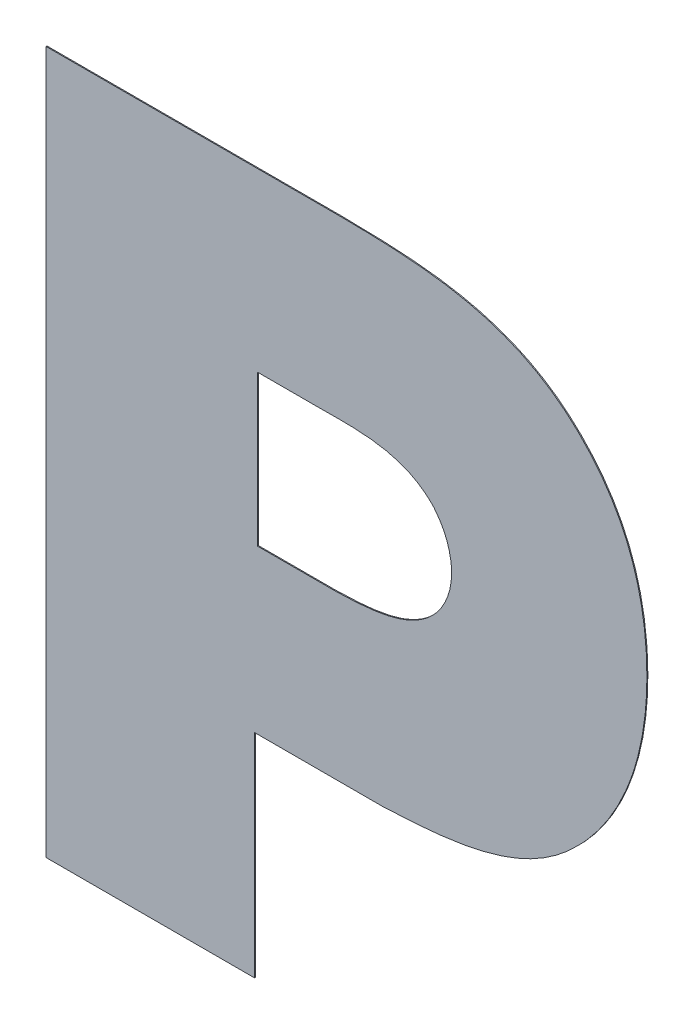
ISO-10303-21;
HEADER;
FILE_DESCRIPTION(('STEP AP214'),'2;1');
FILE_NAME('part.step','',(''),(''),'','','');
FILE_SCHEMA(('AUTOMOTIVE_DESIGN { 1 0 10303 214 1 1 1 1 }'));
ENDSEC;
DATA;
#1=APPLICATION_CONTEXT('core data for automotive mechanical design processes');
#2=APPLICATION_PROTOCOL_DEFINITION('international standard','automotive_design',2000,#1);
#3=PRODUCT_CONTEXT('',#1,'mechanical');
#4=PRODUCT('Part','Part','',(#3));
#5=PRODUCT_RELATED_PRODUCT_CATEGORY('part','',(#4));
#6=PRODUCT_DEFINITION_FORMATION('','',#4);
#7=PRODUCT_DEFINITION_CONTEXT('part definition',#1,'design');
#8=PRODUCT_DEFINITION('design','',#6,#7);
#9=PRODUCT_DEFINITION_SHAPE('','',#8);
#10=(LENGTH_UNIT() NAMED_UNIT(*) SI_UNIT(.MILLI.,.METRE.));
#11=(NAMED_UNIT(*) PLANE_ANGLE_UNIT() SI_UNIT($,.RADIAN.));
#12=(NAMED_UNIT(*) SI_UNIT($,.STERADIAN.) SOLID_ANGLE_UNIT());
#13=UNCERTAINTY_MEASURE_WITH_UNIT(LENGTH_MEASURE(1.E-05),#10,'distance_accuracy_value','');
#14=(GEOMETRIC_REPRESENTATION_CONTEXT(3) GLOBAL_UNCERTAINTY_ASSIGNED_CONTEXT((#13)) GLOBAL_UNIT_ASSIGNED_CONTEXT((#10,
#11,#12)) REPRESENTATION_CONTEXT('',''));
#15=CARTESIAN_POINT('',(0.,0.,0.));
#16=DIRECTION('',(0.,0.,1.));
#17=DIRECTION('',(1.,0.,0.));
#18=AXIS2_PLACEMENT_3D('',#15,#16,#17);
#19=CARTESIAN_POINT('',(2.148991744242,-0.26665578525633,0.));
#20=DIRECTION('',(0.,-1.,0.));
#21=DIRECTION('',(1.,0.,0.));
#22=AXIS2_PLACEMENT_3D('',#19,#20,#21);
#23=PLANE('',#22);
#24=DIRECTION('',(1.,0.,0.));
#25=VECTOR('',#24,1.);
#26=CARTESIAN_POINT('',(2.1490409629657,-0.26665578525633,0.));
#27=LINE('',#26,#25);
#28=CARTESIAN_POINT('',(2.148991744242,-0.26665578525633,0.));
#29=VERTEX_POINT('',#28);
#30=CARTESIAN_POINT('',(2.1571705659487,-0.26665578525633,0.));
#31=VERTEX_POINT('',#30);
#32=EDGE_CURVE('E11',#29,#31,#27,.T.);
#33=ORIENTED_EDGE('',*,*,#32,.F.);
#34=DIRECTION('',(0.,0.,1.));
#35=VECTOR('',#34,1.);
#36=CARTESIAN_POINT('',(2.148991744242,-0.26665578525633,0.));
#37=LINE('',#36,#35);
#38=CARTESIAN_POINT('',(2.148991744242,-0.26665578525633,0.0001));
#39=VERTEX_POINT('',#38);
#40=EDGE_CURVE('E24',#29,#39,#37,.T.);
#41=ORIENTED_EDGE('',*,*,#40,.T.);
#42=DIRECTION('',(-1.,0.,0.));
#43=VECTOR('',#42,1.);
#44=CARTESIAN_POINT('',(2.1490409629657,-0.26665578525633,0.0001));
#45=LINE('',#44,#43);
#46=CARTESIAN_POINT('',(2.1571705659487,-0.26665578525633,0.0001));
#47=VERTEX_POINT('',#46);
#48=EDGE_CURVE('E296',#47,#39,#45,.T.);
#49=ORIENTED_EDGE('',*,*,#48,.F.);
#50=DIRECTION('',(0.,0.,1.));
#51=VECTOR('',#50,1.);
#52=CARTESIAN_POINT('',(2.1571705659487,-0.26665578525633,0.));
#53=LINE('',#52,#51);
#54=EDGE_CURVE('E293',#31,#47,#53,.T.);
#55=ORIENTED_EDGE('',*,*,#54,.F.);
#56=EDGE_LOOP('',(#33,#41,#49,#55));
#57=FACE_BOUND('',#56,.T.);
#58=ADVANCED_FACE('F17',(#57),#23,.F.);
#59=CARTESIAN_POINT('',(2.148991744242,-0.25069301416632,0.));
#60=DIRECTION('',(-1.,0.,0.));
#61=DIRECTION('',(0.,-1.,0.));
#62=AXIS2_PLACEMENT_3D('',#59,#60,#61);
#63=PLANE('',#62);
#64=DIRECTION('',(0.,-1.,0.));
#65=VECTOR('',#64,1.);
#66=CARTESIAN_POINT('',(2.148991744242,-0.259094380213193,0.));
#67=LINE('',#66,#65);
#68=CARTESIAN_POINT('',(2.148991744242,-0.25069301416632,0.));
#69=VERTEX_POINT('',#68);
#70=EDGE_CURVE('E291',#69,#29,#67,.T.);
#71=ORIENTED_EDGE('',*,*,#70,.F.);
#72=DIRECTION('',(0.,0.,1.));
#73=VECTOR('',#72,1.);
#74=CARTESIAN_POINT('',(2.148991744242,-0.25069301416632,0.));
#75=LINE('',#74,#73);
#76=CARTESIAN_POINT('',(2.148991744242,-0.25069301416632,0.0001));
#77=VERTEX_POINT('',#76);
#78=EDGE_CURVE('E289',#69,#77,#75,.T.);
#79=ORIENTED_EDGE('',*,*,#78,.T.);
#80=DIRECTION('',(0.,1.,0.));
#81=VECTOR('',#80,1.);
#82=CARTESIAN_POINT('',(2.148991744242,-0.259094380213193,0.0001));
#83=LINE('',#82,#81);
#84=EDGE_CURVE('E286',#39,#77,#83,.T.);
#85=ORIENTED_EDGE('',*,*,#84,.F.);
#86=ORIENTED_EDGE('',*,*,#40,.F.);
#87=EDGE_LOOP('',(#71,#79,#85,#86));
#88=FACE_BOUND('',#87,.T.);
#89=ADVANCED_FACE('F302',(#88),#63,.F.);
#90=CARTESIAN_POINT('',(2.1551023631287,-0.25069301416632,0.));
#91=DIRECTION('',(0.,1.,0.));
#92=DIRECTION('',(-1.,0.,0.));
#93=AXIS2_PLACEMENT_3D('',#90,#91,#92);
#94=PLANE('',#93);
#95=DIRECTION('',(-1.,0.,0.));
#96=VECTOR('',#95,1.);
#97=CARTESIAN_POINT('',(2.1520962724091,-0.25069301416632,0.));
#98=LINE('',#97,#96);
#99=CARTESIAN_POINT('',(2.1551023631287,-0.25069301416632,0.));
#100=VERTEX_POINT('',#99);
#101=EDGE_CURVE('E283',#100,#69,#98,.T.);
#102=ORIENTED_EDGE('',*,*,#101,.F.);
#103=DIRECTION('',(0.,0.,1.));
#104=VECTOR('',#103,1.);
#105=CARTESIAN_POINT('',(2.1551023631287,-0.25069301416632,0.));
#106=LINE('',#105,#104);
#107=CARTESIAN_POINT('',(2.1551023631287,-0.25069301416632,0.0001));
#108=VERTEX_POINT('',#107);
#109=EDGE_CURVE('E281',#100,#108,#106,.T.);
#110=ORIENTED_EDGE('',*,*,#109,.T.);
#111=DIRECTION('',(1.,0.,0.));
#112=VECTOR('',#111,1.);
#113=CARTESIAN_POINT('',(2.1520962724091,-0.25069301416632,0.0001));
#114=LINE('',#113,#112);
#115=EDGE_CURVE('E275',#77,#108,#114,.T.);
#116=ORIENTED_EDGE('',*,*,#115,.F.);
#117=ORIENTED_EDGE('',*,*,#78,.F.);
#118=EDGE_LOOP('',(#102,#110,#116,#117));
#119=FACE_BOUND('',#118,.T.);
#120=ADVANCED_FACE('F305',(#119),#94,.F.);
#121=CARTESIAN_POINT('',(2.1676996108021,-0.25376713765168,0.));
#122=CARTESIAN_POINT('',(2.1676996108021,-0.25376713765168,0.0001));
#123=CARTESIAN_POINT('',(2.1645032943995,-0.250298193469789,0.));
#124=CARTESIAN_POINT('',(2.1645032943995,-0.250298193469789,0.0001));
#125=CARTESIAN_POINT('',(2.1593327841266,-0.250693014217955,0.));
#126=CARTESIAN_POINT('',(2.1593327841266,-0.250693014217955,0.0001));
#127=CARTESIAN_POINT('',(2.1551023631287,-0.25069301416632,0.));
#128=CARTESIAN_POINT('',(2.1551023631287,-0.25069301416632,0.0001));
#129=B_SPLINE_SURFACE_WITH_KNOTS('',3,1,((#121,#122),(#123,#124),(#125,#126),(#127,#128)),
.UNSPECIFIED.,.F.,.F.,.F.,(4,4),(2,2),(-1.,0.),(0.,1.E-05),.UNSPECIFIED.);
#130=CARTESIAN_POINT('',(2.1676996108021,-0.25376713765168,0.));
#131=CARTESIAN_POINT('',(2.1645032943995,-0.250298193469789,0.));
#132=CARTESIAN_POINT('',(2.1593327841266,-0.250693014217955,0.));
#133=CARTESIAN_POINT('',(2.1551023631287,-0.25069301416632,0.));
#134=B_SPLINE_CURVE_WITH_KNOTS('',3,(#130,#131,#132,#133),.UNSPECIFIED.,.F.,.F.,(4,4),(-1.,0.),.UNSPECIFIED.);
#135=CARTESIAN_POINT('',(2.1676996108021,-0.25376713765168,0.));
#136=VERTEX_POINT('',#135);
#137=EDGE_CURVE('E270',#136,#100,#134,.T.);
#138=DIRECTION('',(0.,0.,1.));
#139=VECTOR('',#138,1.);
#140=CARTESIAN_POINT('',(2.1676996108021,-0.25376713765168,0.));
#141=LINE('',#140,#139);
#142=CARTESIAN_POINT('',(2.1676996108021,-0.25376713765168,0.0001));
#143=VERTEX_POINT('',#142);
#144=EDGE_CURVE('E264',#136,#143,#141,.T.);
#145=CARTESIAN_POINT('',(2.1551023631287,-0.25069301416632,0.0001));
#146=CARTESIAN_POINT('',(2.1593327841266,-0.250693014217955,0.0001));
#147=CARTESIAN_POINT('',(2.1645032943995,-0.250298193469789,0.0001));
#148=CARTESIAN_POINT('',(2.1676996108021,-0.25376713765168,0.0001));
#149=B_SPLINE_CURVE_WITH_KNOTS('',3,(#145,#146,#147,#148),.UNSPECIFIED.,.F.,.F.,(4,4),(0.,1.),.UNSPECIFIED.);
#150=EDGE_CURVE('E260',#108,#143,#149,.T.);
#151=ORIENTED_EDGE('',*,*,#137,.F.);
#152=ORIENTED_EDGE('',*,*,#144,.T.);
#153=ORIENTED_EDGE('',*,*,#150,.F.);
#154=ORIENTED_EDGE('',*,*,#109,.F.);
#155=EDGE_LOOP('',(#151,#152,#153,#154));
#156=FACE_BOUND('',#155,.T.);
#157=ADVANCED_FACE('F310',(#156),#129,.F.);
#158=CARTESIAN_POINT('',(2.1695797828686,-0.25872142675248,0.));
#159=CARTESIAN_POINT('',(2.16947376318438,-0.255884105252941,0.));
#160=CARTESIAN_POINT('',(2.1676996108021,-0.25376713765168,0.));
#161=CARTESIAN_POINT('',(2.1695797828686,-0.25872142675248,0.0001));
#162=CARTESIAN_POINT('',(2.16947376318438,-0.255884105252941,0.0001));
#163=CARTESIAN_POINT('',(2.1676996108021,-0.25376713765168,0.0001));
#164=(BOUNDED_SURFACE() B_SPLINE_SURFACE(1,2,((#158,#159,#160),(#161,#162,#163)),.UNSPECIFIED.,
.F.,.F.,.F.) B_SPLINE_SURFACE_WITH_KNOTS((2,2),(3,3),(0.,0.0016733285659705),(-3.28337692066341,
-3.03707587900119),
.UNSPECIFIED.) GEOMETRIC_REPRESENTATION_ITEM() RATIONAL_B_SPLINE_SURFACE(((1.,0.992426553478268,
1.),(1.,0.992426553478268,1.))) REPRESENTATION_ITEM('') SURFACE());
#165=CARTESIAN_POINT('',(2.1141992768274,-0.279753424382636,0.));
#166=DIRECTION('',(0.,0.,1.));
#167=DIRECTION('',(-0.915373470419152,-0.40260577449013,0.));
#168=AXIS2_PLACEMENT_3D('',#165,#166,#167);
#169=ELLIPSE('',#168,0.0597611264360387,0.0215440188188566);
#170=CARTESIAN_POINT('',(2.1695797828686,-0.25872142675248,0.));
#171=VERTEX_POINT('',#170);
#172=EDGE_CURVE('E257',#171,#136,#169,.T.);
#173=DIRECTION('',(0.,0.,1.));
#174=VECTOR('',#173,1.);
#175=CARTESIAN_POINT('',(2.1695797828686,-0.25872142675248,0.));
#176=LINE('',#175,#174);
#177=CARTESIAN_POINT('',(2.1695797828686,-0.25872142675248,0.0001));
#178=VERTEX_POINT('',#177);
#179=EDGE_CURVE('E255',#171,#178,#176,.T.);
#180=CARTESIAN_POINT('',(2.1141992768274,-0.279753424382636,0.0001));
#181=DIRECTION('',(0.,0.,-1.));
#182=DIRECTION('',(-0.915373470419152,-0.40260577449013,0.));
#183=AXIS2_PLACEMENT_3D('',#180,#181,#182);
#184=ELLIPSE('',#183,0.0597611264360387,0.0215440188188566);
#185=EDGE_CURVE('E252',#143,#178,#184,.T.);
#186=ORIENTED_EDGE('',*,*,#172,.F.);
#187=ORIENTED_EDGE('',*,*,#179,.T.);
#188=ORIENTED_EDGE('',*,*,#185,.F.);
#189=ORIENTED_EDGE('',*,*,#144,.F.);
#190=EDGE_LOOP('',(#186,#187,#188,#189));
#191=FACE_BOUND('',#190,.T.);
#192=ADVANCED_FACE('F333',(#191),#164,.T.);
#193=CARTESIAN_POINT('',(2.1676055954254,-0.263685108359646,0.));
#194=CARTESIAN_POINT('',(2.16958018716928,-0.261617770814213,0.));
#195=CARTESIAN_POINT('',(2.1695797828686,-0.25872142675248,0.));
#196=CARTESIAN_POINT('',(2.1676055954254,-0.263685108359646,0.0001));
#197=CARTESIAN_POINT('',(2.16958018716928,-0.261617770814213,0.0001));
#198=CARTESIAN_POINT('',(2.1695797828686,-0.25872142675248,0.0001));
#199=(BOUNDED_SURFACE() B_SPLINE_SURFACE(1,2,((#193,#194,#195),(#196,#197,#198)),.UNSPECIFIED.,
.F.,.F.,.F.) B_SPLINE_SURFACE_WITH_KNOTS((2,2),(3,3),(0.,0.0036284308680038),(-3.32565261163518,
-2.93267418086352),
.UNSPECIFIED.) GEOMETRIC_REPRESENTATION_ITEM() RATIONAL_B_SPLINE_SURFACE(((1.,0.980758021685963,
1.),(1.,0.980758021685963,1.))) REPRESENTATION_ITEM('') SURFACE());
#200=CARTESIAN_POINT('',(2.1436709223315,-0.250742331624989,0.));
#201=DIRECTION('',(0.,0.,1.));
#202=DIRECTION('',(-0.919658977595631,0.392717920303822,0.));
#203=AXIS2_PLACEMENT_3D('',#200,#201,#202);
#204=ELLIPSE('',#203,0.0275601227191125,0.0136779163636743);
#205=CARTESIAN_POINT('',(2.1676055954254,-0.263685108359646,0.));
#206=VERTEX_POINT('',#205);
#207=EDGE_CURVE('E249',#206,#171,#204,.T.);
#208=DIRECTION('',(0.,0.,1.));
#209=VECTOR('',#208,1.);
#210=CARTESIAN_POINT('',(2.1676055954254,-0.263685108359646,0.));
#211=LINE('',#210,#209);
#212=CARTESIAN_POINT('',(2.1676055954254,-0.263685108359646,0.0001));
#213=VERTEX_POINT('',#212);
#214=EDGE_CURVE('E247',#206,#213,#211,.T.);
#215=CARTESIAN_POINT('',(2.1436709223315,-0.250742331624989,0.0001));
#216=DIRECTION('',(0.,0.,-1.));
#217=DIRECTION('',(-0.919658977595631,0.392717920303822,0.));
#218=AXIS2_PLACEMENT_3D('',#215,#216,#217);
#219=ELLIPSE('',#218,0.0275601227191125,0.0136779163636743);
#220=EDGE_CURVE('E241',#178,#213,#219,.T.);
#221=ORIENTED_EDGE('',*,*,#207,.F.);
#222=ORIENTED_EDGE('',*,*,#214,.T.);
#223=ORIENTED_EDGE('',*,*,#220,.F.);
#224=ORIENTED_EDGE('',*,*,#179,.F.);
#225=EDGE_LOOP('',(#221,#222,#223,#224));
#226=FACE_BOUND('',#225,.T.);
#227=ADVANCED_FACE('F317',(#226),#199,.T.);
#228=CARTESIAN_POINT('',(2.1571705659487,-0.26665578525633,0.));
#229=CARTESIAN_POINT('',(2.1571705659487,-0.26665578525633,0.0001));
#230=CARTESIAN_POINT('',(2.1608369140555,-0.266561789155003,0.));
#231=CARTESIAN_POINT('',(2.1608369140555,-0.266561789155003,0.0001));
#232=CARTESIAN_POINT('',(2.1649733261424,-0.266364365807923,0.));
#233=CARTESIAN_POINT('',(2.1649733261424,-0.266364365807923,0.0001));
#234=CARTESIAN_POINT('',(2.1676055954254,-0.263685108359646,0.));
#235=CARTESIAN_POINT('',(2.1676055954254,-0.263685108359646,0.0001));
#236=B_SPLINE_SURFACE_WITH_KNOTS('',3,1,((#228,#229),(#230,#231),(#232,#233),(#234,#235)),
.UNSPECIFIED.,.F.,.F.,.F.,(4,4),(2,2),(-1.,0.),(0.,1.E-05),.UNSPECIFIED.);
#237=CARTESIAN_POINT('',(2.1571705659487,-0.26665578525633,0.));
#238=CARTESIAN_POINT('',(2.1608369140555,-0.266561789155003,0.));
#239=CARTESIAN_POINT('',(2.1649733261424,-0.266364365807923,0.));
#240=CARTESIAN_POINT('',(2.1676055954254,-0.263685108359646,0.));
#241=B_SPLINE_CURVE_WITH_KNOTS('',3,(#237,#238,#239,#240),.UNSPECIFIED.,.F.,.F.,(4,4),(-1.,0.),.UNSPECIFIED.);
#242=EDGE_CURVE('E234',#31,#206,#241,.T.);
#243=CARTESIAN_POINT('',(2.1676055954254,-0.263685108359646,0.0001));
#244=CARTESIAN_POINT('',(2.1649733261424,-0.266364365807923,0.0001));
#245=CARTESIAN_POINT('',(2.1608369140555,-0.266561789155003,0.0001));
#246=CARTESIAN_POINT('',(2.1571705659487,-0.26665578525633,0.0001));
#247=B_SPLINE_CURVE_WITH_KNOTS('',3,(#243,#244,#245,#246),.UNSPECIFIED.,.F.,.F.,(4,4),(0.,1.),.UNSPECIFIED.);
#248=EDGE_CURVE('E229',#213,#47,#247,.T.);
#249=ORIENTED_EDGE('',*,*,#242,.F.);
#250=ORIENTED_EDGE('',*,*,#54,.T.);
#251=ORIENTED_EDGE('',*,*,#248,.F.);
#252=ORIENTED_EDGE('',*,*,#214,.F.);
#253=EDGE_LOOP('',(#249,#250,#251,#252));
#254=FACE_BOUND('',#253,.T.);
#255=ADVANCED_FACE('F321',(#254),#236,.F.);
#256=CARTESIAN_POINT('',(2.1826470816222,-0.27745745793,0.));
#257=CARTESIAN_POINT('',(2.1826470816222,-0.27745745793,0.0001));
#258=CARTESIAN_POINT('',(2.1857493826267,-0.274552580185439,0.));
#259=CARTESIAN_POINT('',(2.1857493826267,-0.274552580185439,0.0001));
#260=CARTESIAN_POINT('',(2.1902618046175,-0.268319761951759,0.));
#261=CARTESIAN_POINT('',(2.1902618046175,-0.268319761951759,0.0001));
#262=CARTESIAN_POINT('',(2.1902618046175,-0.257959943486377,0.));
#263=CARTESIAN_POINT('',(2.1902618046175,-0.257959943486377,0.0001));
#264=B_SPLINE_SURFACE_WITH_KNOTS('',3,1,((#256,#257),(#258,#259),(#260,#261),(#262,#263)),
.UNSPECIFIED.,.F.,.F.,.F.,(4,4),(2,2),(-1.,0.),(0.,1.E-05),.UNSPECIFIED.);
#265=CARTESIAN_POINT('',(2.1644326296189,-0.253470463650479,0.));
#266=DIRECTION('',(0.,0.,-1.));
#267=DIRECTION('',(-0.413300305480635,0.910594782265753,0.));
#268=AXIS2_PLACEMENT_3D('',#265,#266,#267);
#269=ELLIPSE('',#268,0.0304988381918747,0.0247583572626639);
#270=CARTESIAN_POINT('',(2.1902618046175,-0.257959943486377,0.));
#271=VERTEX_POINT('',#270);
#272=CARTESIAN_POINT('',(2.1826470816222,-0.27745745793,0.));
#273=VERTEX_POINT('',#272);
#274=EDGE_CURVE('E227',#271,#273,#269,.T.);
#275=DIRECTION('',(0.,0.,1.));
#276=VECTOR('',#275,1.);
#277=CARTESIAN_POINT('',(2.1902618046175,-0.257959943486377,0.));
#278=LINE('',#277,#276);
#279=CARTESIAN_POINT('',(2.1902618046175,-0.257959943486377,0.0001));
#280=VERTEX_POINT('',#279);
#281=EDGE_CURVE('E225',#271,#280,#278,.T.);
#282=CARTESIAN_POINT('',(2.1644326296189,-0.253470463650479,0.0001));
#283=DIRECTION('',(0.,0.,1.));
#284=DIRECTION('',(0.413300305480625,-0.910594782265758,0.));
#285=AXIS2_PLACEMENT_3D('',#282,#283,#284);
#286=ELLIPSE('',#285,0.0304988381918745,0.0247583572626637);
#287=CARTESIAN_POINT('',(2.1826470816222,-0.27745745793,0.0001));
#288=VERTEX_POINT('',#287);
#289=EDGE_CURVE('E152',#288,#280,#286,.T.);
#290=DIRECTION('',(0.,0.,1.));
#291=VECTOR('',#290,1.);
#292=CARTESIAN_POINT('',(2.1826470816222,-0.27745745793,0.));
#293=LINE('',#292,#291);
#294=EDGE_CURVE('E218',#273,#288,#293,.T.);
#295=ORIENTED_EDGE('',*,*,#274,.F.);
#296=ORIENTED_EDGE('',*,*,#281,.T.);
#297=ORIENTED_EDGE('',*,*,#289,.F.);
#298=ORIENTED_EDGE('',*,*,#294,.F.);
#299=EDGE_LOOP('',(#295,#296,#297,#298));
#300=FACE_BOUND('',#299,.T.);
#301=ADVANCED_FACE('F323',(#300),#264,.T.);
#302=CARTESIAN_POINT('',(2.1623410697733,-0.283915889844673,0.));
#303=CARTESIAN_POINT('',(2.1623410697733,-0.283915889844673,0.0001));
#304=CARTESIAN_POINT('',(2.1696737981163,-0.283577462598871,0.));
#305=CARTESIAN_POINT('',(2.1696737981163,-0.283577462598871,0.0001));
#306=CARTESIAN_POINT('',(2.1771005226245,-0.28301341565108,0.));
#307=CARTESIAN_POINT('',(2.1771005226245,-0.28301341565108,0.0001));
#308=CARTESIAN_POINT('',(2.1826470816222,-0.27745745793,0.));
#309=CARTESIAN_POINT('',(2.1826470816222,-0.27745745793,0.0001));
#310=B_SPLINE_SURFACE_WITH_KNOTS('',3,1,((#302,#303),(#304,#305),(#306,#307),(#308,#309)),
.UNSPECIFIED.,.F.,.F.,.F.,(4,4),(2,2),(-1.,0.),(0.,1.E-05),.UNSPECIFIED.);
#311=CARTESIAN_POINT('',(2.1826470816222,-0.27745745793,0.));
#312=CARTESIAN_POINT('',(2.1771005226245,-0.28301341565108,0.));
#313=CARTESIAN_POINT('',(2.1696737981163,-0.283577462598871,0.));
#314=CARTESIAN_POINT('',(2.1623410697733,-0.283915889844673,0.));
#315=B_SPLINE_CURVE_WITH_KNOTS('',3,(#311,#312,#313,#314),.UNSPECIFIED.,.F.,.F.,(4,4),(0.,1.),.UNSPECIFIED.);
#316=CARTESIAN_POINT('',(2.1623410697733,-0.283915889844673,0.));
#317=VERTEX_POINT('',#316);
#318=EDGE_CURVE('E211',#273,#317,#315,.T.);
#319=CARTESIAN_POINT('',(2.1623410697733,-0.283915889844673,0.0001));
#320=CARTESIAN_POINT('',(2.1696737981163,-0.283577462598871,0.0001));
#321=CARTESIAN_POINT('',(2.1771005226245,-0.28301341565108,0.0001));
#322=CARTESIAN_POINT('',(2.1826470816222,-0.27745745793,0.0001));
#323=B_SPLINE_CURVE_WITH_KNOTS('',3,(#319,#320,#321,#322),.UNSPECIFIED.,.F.,.F.,(4,4),(-1.,0.),.UNSPECIFIED.);
#324=CARTESIAN_POINT('',(2.1623410697733,-0.283915889844673,0.0001));
#325=VERTEX_POINT('',#324);
#326=EDGE_CURVE('E207',#325,#288,#323,.T.);
#327=DIRECTION('',(0.,0.,1.));
#328=VECTOR('',#327,1.);
#329=CARTESIAN_POINT('',(2.1623410697733,-0.283915889844673,0.));
#330=LINE('',#329,#328);
#331=EDGE_CURVE('E204',#317,#325,#330,.T.);
#332=ORIENTED_EDGE('',*,*,#318,.F.);
#333=ORIENTED_EDGE('',*,*,#294,.T.);
#334=ORIENTED_EDGE('',*,*,#326,.F.);
#335=ORIENTED_EDGE('',*,*,#331,.F.);
#336=EDGE_LOOP('',(#332,#333,#334,#335));
#337=FACE_BOUND('',#336,.T.);
#338=ADVANCED_FACE('F330',(#337),#310,.T.);
#339=CARTESIAN_POINT('',(2.1487097303663,-0.283915889844673,0.));
#340=DIRECTION('',(0.,-1.,0.));
#341=DIRECTION('',(1.,0.,0.));
#342=AXIS2_PLACEMENT_3D('',#339,#340,#341);
#343=PLANE('',#342);
#344=DIRECTION('',(-1.,0.,0.));
#345=VECTOR('',#344,1.);
#346=CARTESIAN_POINT('',(2.1623410697733,-0.283915889844673,0.));
#347=LINE('',#346,#345);
#348=CARTESIAN_POINT('',(2.1487097303663,-0.283915889844673,0.));
#349=VERTEX_POINT('',#348);
#350=EDGE_CURVE('E202',#317,#349,#347,.T.);
#351=ORIENTED_EDGE('',*,*,#350,.F.);
#352=ORIENTED_EDGE('',*,*,#331,.T.);
#353=DIRECTION('',(1.,0.,0.));
#354=VECTOR('',#353,1.);
#355=CARTESIAN_POINT('',(2.1623410697733,-0.283915889844673,0.0001));
#356=LINE('',#355,#354);
#357=CARTESIAN_POINT('',(2.1487097303663,-0.283915889844673,0.0001));
#358=VERTEX_POINT('',#357);
#359=EDGE_CURVE('E199',#358,#325,#356,.T.);
#360=ORIENTED_EDGE('',*,*,#359,.F.);
#361=DIRECTION('',(0.,0.,1.));
#362=VECTOR('',#361,1.);
#363=CARTESIAN_POINT('',(2.1487097303663,-0.283915889844673,0.));
#364=LINE('',#363,#362);
#365=EDGE_CURVE('E196',#349,#358,#364,.T.);
#366=ORIENTED_EDGE('',*,*,#365,.F.);
#367=EDGE_LOOP('',(#351,#352,#360,#366));
#368=FACE_BOUND('',#367,.T.);
#369=ADVANCED_FACE('F405',(#368),#343,.T.);
#370=CARTESIAN_POINT('',(2.1487097303663,-0.306431114677033,0.));
#371=DIRECTION('',(1.,0.,0.));
#372=DIRECTION('',(0.,1.,0.));
#373=AXIS2_PLACEMENT_3D('',#370,#371,#372);
#374=PLANE('',#373);
#375=DIRECTION('',(0.,-1.,0.));
#376=VECTOR('',#375,1.);
#377=CARTESIAN_POINT('',(2.1487097303663,-0.283915889844673,0.));
#378=LINE('',#377,#376);
#379=CARTESIAN_POINT('',(2.1487097303663,-0.306431114677033,0.));
#380=VERTEX_POINT('',#379);
#381=EDGE_CURVE('E194',#349,#380,#378,.T.);
#382=ORIENTED_EDGE('',*,*,#381,.F.);
#383=ORIENTED_EDGE('',*,*,#365,.T.);
#384=DIRECTION('',(0.,1.,0.));
#385=VECTOR('',#384,1.);
#386=CARTESIAN_POINT('',(2.1487097303663,-0.283915889844673,0.0001));
#387=LINE('',#386,#385);
#388=CARTESIAN_POINT('',(2.1487097303663,-0.306431114677033,0.0001));
#389=VERTEX_POINT('',#388);
#390=EDGE_CURVE('E191',#389,#358,#387,.T.);
#391=ORIENTED_EDGE('',*,*,#390,.F.);
#392=DIRECTION('',(0.,0.,1.));
#393=VECTOR('',#392,1.);
#394=CARTESIAN_POINT('',(2.1487097303663,-0.306431114677033,0.));
#395=LINE('',#394,#393);
#396=EDGE_CURVE('E188',#380,#389,#395,.T.);
#397=ORIENTED_EDGE('',*,*,#396,.F.);
#398=EDGE_LOOP('',(#382,#383,#391,#397));
#399=FACE_BOUND('',#398,.T.);
#400=ADVANCED_FACE('F415',(#399),#374,.T.);
#401=CARTESIAN_POINT('',(2.1266175618275,-0.306431114677033,0.));
#402=DIRECTION('',(0.,-1.,0.));
#403=DIRECTION('',(1.,0.,0.));
#404=AXIS2_PLACEMENT_3D('',#401,#402,#403);
#405=PLANE('',#404);
#406=DIRECTION('',(-1.,0.,0.));
#407=VECTOR('',#406,1.);
#408=CARTESIAN_POINT('',(2.1487097303663,-0.306431114677033,0.));
#409=LINE('',#408,#407);
#410=CARTESIAN_POINT('',(2.1266175618275,-0.306431114677033,0.));
#411=VERTEX_POINT('',#410);
#412=EDGE_CURVE('E186',#380,#411,#409,.T.);
#413=ORIENTED_EDGE('',*,*,#412,.F.);
#414=ORIENTED_EDGE('',*,*,#396,.T.);
#415=DIRECTION('',(1.,0.,0.));
#416=VECTOR('',#415,1.);
#417=CARTESIAN_POINT('',(2.1487097303663,-0.306431114677033,0.0001));
#418=LINE('',#417,#416);
#419=CARTESIAN_POINT('',(2.1266175618275,-0.306431114677033,0.0001));
#420=VERTEX_POINT('',#419);
#421=EDGE_CURVE('E183',#420,#389,#418,.T.);
#422=ORIENTED_EDGE('',*,*,#421,.F.);
#423=DIRECTION('',(0.,0.,1.));
#424=VECTOR('',#423,1.);
#425=CARTESIAN_POINT('',(2.1266175618275,-0.306431114677033,0.));
#426=LINE('',#425,#424);
#427=EDGE_CURVE('E180',#411,#420,#426,.T.);
#428=ORIENTED_EDGE('',*,*,#427,.F.);
#429=EDGE_LOOP('',(#413,#414,#422,#428));
#430=FACE_BOUND('',#429,.T.);
#431=ADVANCED_FACE('F425',(#430),#405,.T.);
#432=CARTESIAN_POINT('',(2.1266175618275,-0.232013396085438,0.));
#433=DIRECTION('',(-1.,0.,0.));
#434=DIRECTION('',(0.,-1.,0.));
#435=AXIS2_PLACEMENT_3D('',#432,#433,#434);
#436=PLANE('',#435);
#437=DIRECTION('',(0.,1.,0.));
#438=VECTOR('',#437,1.);
#439=CARTESIAN_POINT('',(2.1266175618275,-0.306431114677033,0.));
#440=LINE('',#439,#438);
#441=CARTESIAN_POINT('',(2.1266175618275,-0.232013396085438,0.));
#442=VERTEX_POINT('',#441);
#443=EDGE_CURVE('E178',#411,#442,#440,.T.);
#444=ORIENTED_EDGE('',*,*,#443,.F.);
#445=ORIENTED_EDGE('',*,*,#427,.T.);
#446=DIRECTION('',(0.,-1.,0.));
#447=VECTOR('',#446,1.);
#448=CARTESIAN_POINT('',(2.1266175618275,-0.306431114677033,0.0001));
#449=LINE('',#448,#447);
#450=CARTESIAN_POINT('',(2.1266175618275,-0.232013396085438,0.0001));
#451=VERTEX_POINT('',#450);
#452=EDGE_CURVE('E175',#451,#420,#449,.T.);
#453=ORIENTED_EDGE('',*,*,#452,.F.);
#454=DIRECTION('',(0.,0.,1.));
#455=VECTOR('',#454,1.);
#456=CARTESIAN_POINT('',(2.1266175618275,-0.232013396085438,0.));
#457=LINE('',#456,#455);
#458=EDGE_CURVE('E172',#442,#451,#457,.T.);
#459=ORIENTED_EDGE('',*,*,#458,.F.);
#460=EDGE_LOOP('',(#444,#445,#453,#459));
#461=FACE_BOUND('',#460,.T.);
#462=ADVANCED_FACE('F435',(#461),#436,.T.);
#463=CARTESIAN_POINT('',(2.1578286284298,-0.232013396085438,0.));
#464=DIRECTION('',(0.,1.,0.));
#465=DIRECTION('',(-1.,0.,0.));
#466=AXIS2_PLACEMENT_3D('',#463,#464,#465);
#467=PLANE('',#466);
#468=DIRECTION('',(1.,0.,0.));
#469=VECTOR('',#468,1.);
#470=CARTESIAN_POINT('',(2.1266175618275,-0.232013396085438,0.));
#471=LINE('',#470,#469);
#472=CARTESIAN_POINT('',(2.1578286284298,-0.232013396085438,0.));
#473=VERTEX_POINT('',#472);
#474=EDGE_CURVE('E170',#442,#473,#471,.T.);
#475=ORIENTED_EDGE('',*,*,#474,.F.);
#476=ORIENTED_EDGE('',*,*,#458,.T.);
#477=DIRECTION('',(-1.,0.,0.));
#478=VECTOR('',#477,1.);
#479=CARTESIAN_POINT('',(2.1266175618275,-0.232013396085438,0.0001));
#480=LINE('',#479,#478);
#481=CARTESIAN_POINT('',(2.1578286284298,-0.232013396085438,0.0001));
#482=VERTEX_POINT('',#481);
#483=EDGE_CURVE('E168',#482,#451,#480,.T.);
#484=ORIENTED_EDGE('',*,*,#483,.F.);
#485=DIRECTION('',(0.,0.,1.));
#486=VECTOR('',#485,1.);
#487=CARTESIAN_POINT('',(2.1578286284298,-0.232013396085438,0.));
#488=LINE('',#487,#486);
#489=EDGE_CURVE('E134',#473,#482,#488,.T.);
#490=ORIENTED_EDGE('',*,*,#489,.F.);
#491=EDGE_LOOP('',(#475,#476,#484,#490));
#492=FACE_BOUND('',#491,.T.);
#493=ADVANCED_FACE('F445',(#492),#467,.T.);
#494=CARTESIAN_POINT('',(2.185561364775,-0.242147581517037,0.));
#495=CARTESIAN_POINT('',(2.185561364775,-0.242147581517037,0.0001));
#496=CARTESIAN_POINT('',(2.1785106501787,-0.232680851072937,0.));
#497=CARTESIAN_POINT('',(2.1785106501787,-0.232680851072937,0.0001));
#498=CARTESIAN_POINT('',(2.1683576539306,-0.232126190024094,0.));
#499=CARTESIAN_POINT('',(2.1683576539306,-0.232126190024094,0.0001));
#500=CARTESIAN_POINT('',(2.1578286284298,-0.232013396085438,0.));
#501=CARTESIAN_POINT('',(2.1578286284298,-0.232013396085438,0.0001));
#502=B_SPLINE_SURFACE_WITH_KNOTS('',3,1,((#494,#495),(#496,#497),(#498,#499),(#500,#501)),
.UNSPECIFIED.,.F.,.F.,.F.,(4,4),(2,2),(-1.,0.),(0.,1.E-05),.UNSPECIFIED.);
#503=CARTESIAN_POINT('',(2.1578286284298,-0.232013396085438,0.));
#504=CARTESIAN_POINT('',(2.1683576539306,-0.232126190024094,0.));
#505=CARTESIAN_POINT('',(2.1785106501787,-0.232680851072937,0.));
#506=CARTESIAN_POINT('',(2.185561364775,-0.242147581517037,0.));
#507=B_SPLINE_CURVE_WITH_KNOTS('',3,(#503,#504,#505,#506),.UNSPECIFIED.,.F.,.F.,(4,4),(0.,1.),.UNSPECIFIED.);
#508=CARTESIAN_POINT('',(2.185561364775,-0.242147581517037,0.));
#509=VERTEX_POINT('',#508);
#510=EDGE_CURVE('E138',#473,#509,#507,.T.);
#511=CARTESIAN_POINT('',(2.185561364775,-0.242147581517037,0.0001));
#512=CARTESIAN_POINT('',(2.1785106501787,-0.232680851072937,0.0001));
#513=CARTESIAN_POINT('',(2.1683576539306,-0.232126190024094,0.0001));
#514=CARTESIAN_POINT('',(2.1578286284298,-0.232013396085438,0.0001));
#515=B_SPLINE_CURVE_WITH_KNOTS('',3,(#511,#512,#513,#514),.UNSPECIFIED.,.F.,.F.,(4,4),(-1.,0.),.UNSPECIFIED.);
#516=CARTESIAN_POINT('',(2.185561364775,-0.242147581517037,0.0001));
#517=VERTEX_POINT('',#516);
#518=EDGE_CURVE('E127',#517,#482,#515,.T.);
#519=DIRECTION('',(0.,0.,1.));
#520=VECTOR('',#519,1.);
#521=CARTESIAN_POINT('',(2.185561364775,-0.242147581517037,0.));
#522=LINE('',#521,#520);
#523=EDGE_CURVE('E131',#509,#517,#522,.T.);
#524=ORIENTED_EDGE('',*,*,#510,.F.);
#525=ORIENTED_EDGE('',*,*,#489,.T.);
#526=ORIENTED_EDGE('',*,*,#518,.F.);
#527=ORIENTED_EDGE('',*,*,#523,.F.);
#528=EDGE_LOOP('',(#524,#525,#526,#527));
#529=FACE_BOUND('',#528,.T.);
#530=ADVANCED_FACE('F130',(#529),#502,.T.);
#531=CARTESIAN_POINT('',(2.1902618046175,-0.257959943486377,0.));
#532=CARTESIAN_POINT('',(2.1902618046175,-0.257959943486377,0.0001));
#533=CARTESIAN_POINT('',(2.1902618046175,-0.25502397769724,0.));
#534=CARTESIAN_POINT('',(2.1902618046175,-0.25502397769724,0.0001));
#535=CARTESIAN_POINT('',(2.1899152916661,-0.252085113986014,0.));
#536=CARTESIAN_POINT('',(2.1899152916661,-0.252085113986014,0.0001));
#537=CARTESIAN_POINT('',(2.188106889283,-0.246000738037295,0.));
#538=CARTESIAN_POINT('',(2.188106889283,-0.246000738037295,0.0001));
#539=CARTESIAN_POINT('',(2.1867068478546,-0.243696714009487,0.));
#540=CARTESIAN_POINT('',(2.1867068478546,-0.243696714009487,0.0001));
#541=CARTESIAN_POINT('',(2.185561364775,-0.242147581517037,0.));
#542=CARTESIAN_POINT('',(2.185561364775,-0.242147581517037,0.0001));
#543=B_SPLINE_SURFACE_WITH_KNOTS('',3,1,((#531,#532),(#533,#534),(#535,#536),(#537,#538),(#539,
#540),(#541,#542)),.UNSPECIFIED.,.F.,.F.,.F.,(4,2,4),(2,2),(-0.0066277342558988,
-0.0035654314926642,0.),(0.,1.E-05),.UNSPECIFIED.);
#544=CARTESIAN_POINT('',(2.0851936829255,-0.318584644007714,0.));
#545=DIRECTION('',(0.,0.,-1.));
#546=DIRECTION('',(0.793957647733758,0.607973069802502,0.));
#547=AXIS2_PLACEMENT_3D('',#544,#545,#546);
#548=ELLIPSE('',#547,0.126161935594626,0.0521649912755173);
#549=EDGE_CURVE('E146',#509,#271,#548,.T.);
#550=CARTESIAN_POINT('',(2.0851936829255,-0.318584644007695,0.0001));
#551=DIRECTION('',(0.,0.,1.));
#552=DIRECTION('',(0.793957647733745,0.607973069802519,0.));
#553=AXIS2_PLACEMENT_3D('',#550,#551,#552);
#554=ELLIPSE('',#553,0.126161935594591,0.05216499127551);
#555=EDGE_CURVE('E144',#280,#517,#554,.T.);
#556=ORIENTED_EDGE('',*,*,#549,.F.);
#557=ORIENTED_EDGE('',*,*,#523,.T.);
#558=ORIENTED_EDGE('',*,*,#555,.F.);
#559=ORIENTED_EDGE('',*,*,#281,.F.);
#560=EDGE_LOOP('',(#556,#557,#558,#559));
#561=FACE_BOUND('',#560,.T.);
#562=ADVANCED_FACE('F142',(#561),#543,.T.);
#563=CARTESIAN_POINT('',(2.1490901816894,-0.267495746260065,0.));
#564=DIRECTION('',(0.,0.,1.));
#565=DIRECTION('',(1.,0.,0.));
#566=AXIS2_PLACEMENT_3D('',#563,#564,#565);
#567=PLANE('',#566);
#568=ORIENTED_EDGE('',*,*,#549,.T.);
#569=ORIENTED_EDGE('',*,*,#274,.T.);
#570=ORIENTED_EDGE('',*,*,#318,.T.);
#571=ORIENTED_EDGE('',*,*,#350,.T.);
#572=ORIENTED_EDGE('',*,*,#381,.T.);
#573=ORIENTED_EDGE('',*,*,#412,.T.);
#574=ORIENTED_EDGE('',*,*,#443,.T.);
#575=ORIENTED_EDGE('',*,*,#474,.T.);
#576=ORIENTED_EDGE('',*,*,#510,.T.);
#577=EDGE_LOOP('',(#568,#569,#570,#571,#572,#573,#574,#575,#576));
#578=FACE_BOUND('',#577,.T.);
#579=ORIENTED_EDGE('',*,*,#32,.T.);
#580=ORIENTED_EDGE('',*,*,#242,.T.);
#581=ORIENTED_EDGE('',*,*,#207,.T.);
#582=ORIENTED_EDGE('',*,*,#172,.T.);
#583=ORIENTED_EDGE('',*,*,#137,.T.);
#584=ORIENTED_EDGE('',*,*,#101,.T.);
#585=ORIENTED_EDGE('',*,*,#70,.T.);
#586=EDGE_LOOP('',(#579,#580,#581,#582,#583,#584,#585));
#587=FACE_BOUND('',#586,.T.);
#588=ADVANCED_FACE('F307',(#578,#587),#567,.F.);
#589=CARTESIAN_POINT('',(2.1490901816894,-0.267495746260065,0.0001));
#590=DIRECTION('',(0.,0.,1.));
#591=DIRECTION('',(1.,0.,0.));
#592=AXIS2_PLACEMENT_3D('',#589,#590,#591);
#593=PLANE('',#592);
#594=ORIENTED_EDGE('',*,*,#555,.T.);
#595=ORIENTED_EDGE('',*,*,#518,.T.);
#596=ORIENTED_EDGE('',*,*,#483,.T.);
#597=ORIENTED_EDGE('',*,*,#452,.T.);
#598=ORIENTED_EDGE('',*,*,#421,.T.);
#599=ORIENTED_EDGE('',*,*,#390,.T.);
#600=ORIENTED_EDGE('',*,*,#359,.T.);
#601=ORIENTED_EDGE('',*,*,#326,.T.);
#602=ORIENTED_EDGE('',*,*,#289,.T.);
#603=EDGE_LOOP('',(#594,#595,#596,#597,#598,#599,#600,#601,#602));
#604=FACE_BOUND('',#603,.T.);
#605=ORIENTED_EDGE('',*,*,#48,.T.);
#606=ORIENTED_EDGE('',*,*,#84,.T.);
#607=ORIENTED_EDGE('',*,*,#115,.T.);
#608=ORIENTED_EDGE('',*,*,#150,.T.);
#609=ORIENTED_EDGE('',*,*,#185,.T.);
#610=ORIENTED_EDGE('',*,*,#220,.T.);
#611=ORIENTED_EDGE('',*,*,#248,.T.);
#612=EDGE_LOOP('',(#605,#606,#607,#608,#609,#610,#611));
#613=FACE_BOUND('',#612,.T.);
#614=ADVANCED_FACE('F149',(#604,#613),#593,.T.);
#615=CLOSED_SHELL('',(#58,#89,#120,#157,#192,#227,#255,#301,#338,#369,#400,#431,#462,#493,#530,
#562,#588,#614));
#616=MANIFOLD_SOLID_BREP('B1',#615);
#617=ADVANCED_BREP_SHAPE_REPRESENTATION('',(#18,#616),#14);
#618=SHAPE_DEFINITION_REPRESENTATION(#9,#617);
ENDSEC;
END-ISO-10303-21;
